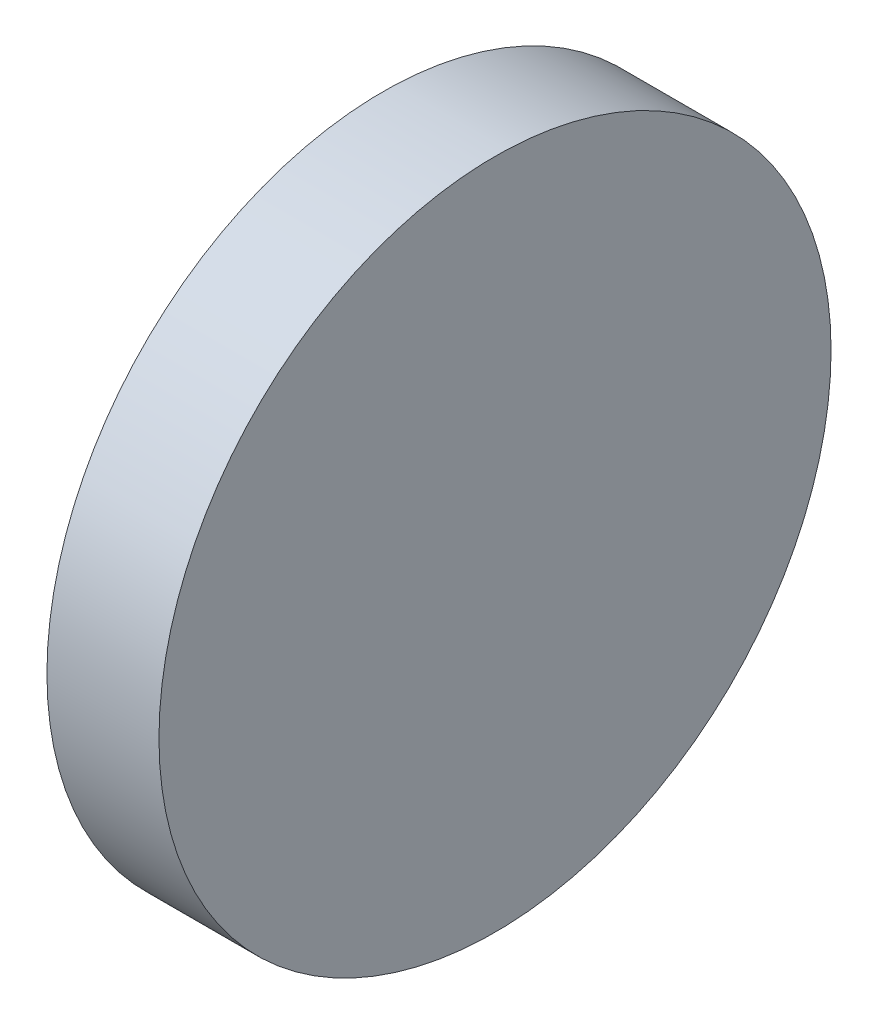
ISO-10303-21;
HEADER;
FILE_DESCRIPTION(('STEP AP214'),'2;1');
FILE_NAME('part.step','',(''),(''),'','','');
FILE_SCHEMA(('AUTOMOTIVE_DESIGN { 1 0 10303 214 1 1 1 1 }'));
ENDSEC;
DATA;
#1=APPLICATION_CONTEXT('core data for automotive mechanical design processes');
#2=APPLICATION_PROTOCOL_DEFINITION('international standard','automotive_design',2000,#1);
#3=PRODUCT_CONTEXT('',#1,'mechanical');
#4=PRODUCT('Part','Part','',(#3));
#5=PRODUCT_RELATED_PRODUCT_CATEGORY('part','',(#4));
#6=PRODUCT_DEFINITION_FORMATION('','',#4);
#7=PRODUCT_DEFINITION_CONTEXT('part definition',#1,'design');
#8=PRODUCT_DEFINITION('design','',#6,#7);
#9=PRODUCT_DEFINITION_SHAPE('','',#8);
#10=(LENGTH_UNIT() NAMED_UNIT(*) SI_UNIT(.MILLI.,.METRE.));
#11=(NAMED_UNIT(*) PLANE_ANGLE_UNIT() SI_UNIT($,.RADIAN.));
#12=(NAMED_UNIT(*) SI_UNIT($,.STERADIAN.) SOLID_ANGLE_UNIT());
#13=UNCERTAINTY_MEASURE_WITH_UNIT(LENGTH_MEASURE(1.E-05),#10,'distance_accuracy_value','');
#14=(GEOMETRIC_REPRESENTATION_CONTEXT(3) GLOBAL_UNCERTAINTY_ASSIGNED_CONTEXT((#13)) GLOBAL_UNIT_ASSIGNED_CONTEXT((#10,
#11,#12)) REPRESENTATION_CONTEXT('',''));
#15=CARTESIAN_POINT('',(0.,0.,0.));
#16=DIRECTION('',(0.,0.,1.));
#17=DIRECTION('',(1.,0.,0.));
#18=AXIS2_PLACEMENT_3D('',#15,#16,#17);
#19=CARTESIAN_POINT('',(1.,0.,0.));
#20=DIRECTION('',(-1.,0.,0.));
#21=DIRECTION('',(0.,0.,1.));
#22=AXIS2_PLACEMENT_3D('',#19,#20,#21);
#23=CYLINDRICAL_SURFACE('',#22,3.);
#24=CARTESIAN_POINT('',(1.,0.,0.));
#25=DIRECTION('',(1.,0.,0.));
#26=DIRECTION('',(0.,0.,-1.));
#27=AXIS2_PLACEMENT_3D('',#24,#25,#26);
#28=CIRCLE('',#27,3.);
#29=CARTESIAN_POINT('',(1.,0.,-3.));
#30=VERTEX_POINT('',#29);
#31=EDGE_CURVE('E10',#30,#30,#28,.T.);
#32=ORIENTED_EDGE('',*,*,#31,.F.);
#33=EDGE_LOOP('',(#32));
#34=FACE_BOUND('',#33,.T.);
#35=CARTESIAN_POINT('',(0.,0.,0.));
#36=DIRECTION('',(1.,0.,0.));
#37=DIRECTION('',(0.,0.,-1.));
#38=AXIS2_PLACEMENT_3D('',#35,#36,#37);
#39=CIRCLE('',#38,3.);
#40=CARTESIAN_POINT('',(0.,0.,-3.));
#41=VERTEX_POINT('',#40);
#42=EDGE_CURVE('E40',#41,#41,#39,.T.);
#43=ORIENTED_EDGE('',*,*,#42,.T.);
#44=EDGE_LOOP('',(#43));
#45=FACE_BOUND('',#44,.T.);
#46=ADVANCED_FACE('F37',(#34,#45),#23,.T.);
#47=CARTESIAN_POINT('',(1.,0.,0.));
#48=DIRECTION('',(1.,0.,0.));
#49=DIRECTION('',(0.,0.,-1.));
#50=AXIS2_PLACEMENT_3D('',#47,#48,#49);
#51=PLANE('',#50);
#52=ORIENTED_EDGE('',*,*,#31,.T.);
#53=EDGE_LOOP('',(#52));
#54=FACE_BOUND('',#53,.T.);
#55=ADVANCED_FACE('F54',(#54),#51,.T.);
#56=CARTESIAN_POINT('',(0.,0.,0.));
#57=DIRECTION('',(1.,0.,0.));
#58=DIRECTION('',(0.,0.,-1.));
#59=AXIS2_PLACEMENT_3D('',#56,#57,#58);
#60=PLANE('',#59);
#61=ORIENTED_EDGE('',*,*,#42,.F.);
#62=EDGE_LOOP('',(#61));
#63=FACE_BOUND('',#62,.T.);
#64=ADVANCED_FACE('F52',(#63),#60,.F.);
#65=CLOSED_SHELL('',(#46,#55,#64));
#66=MANIFOLD_SOLID_BREP('B2',#65);
#67=ADVANCED_BREP_SHAPE_REPRESENTATION('',(#18,#66),#14);
#68=SHAPE_DEFINITION_REPRESENTATION(#9,#67);
ENDSEC;
END-ISO-10303-21;
